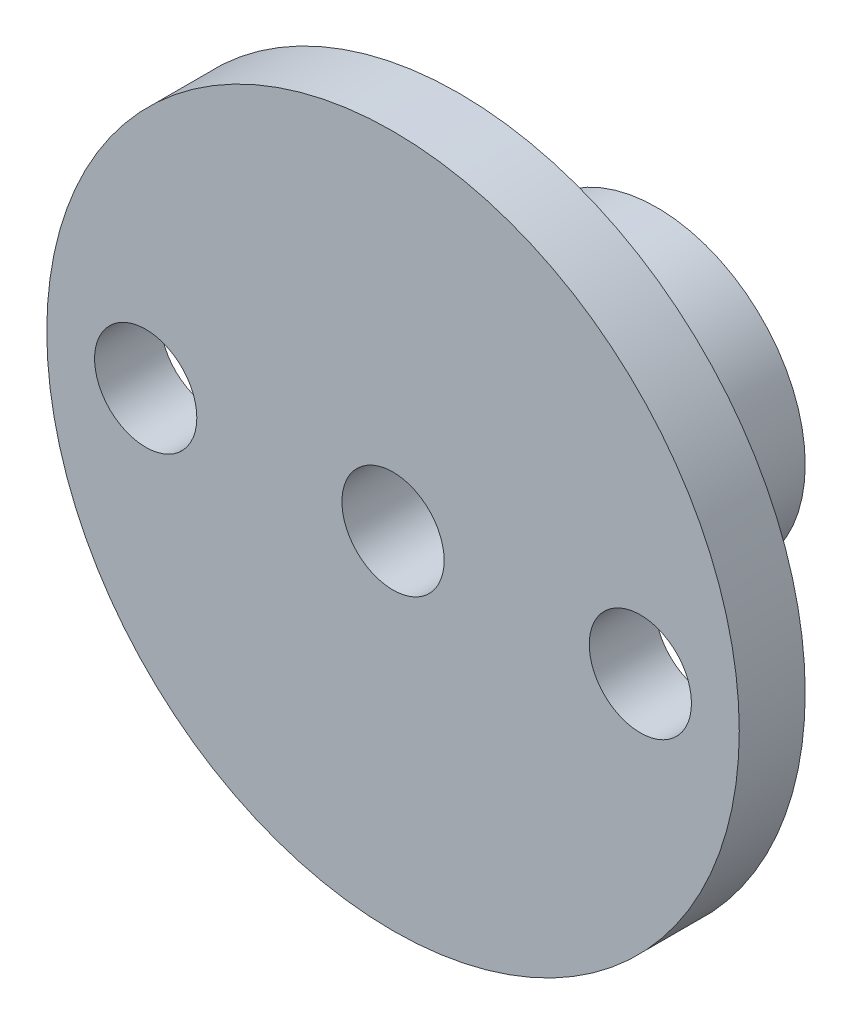
ISO-10303-21;
HEADER;
FILE_DESCRIPTION(('STEP AP214'),'2;1');
FILE_NAME('part.step','',(''),(''),'','','');
FILE_SCHEMA(('AUTOMOTIVE_DESIGN { 1 0 10303 214 1 1 1 1 }'));
ENDSEC;
DATA;
#1=APPLICATION_CONTEXT('core data for automotive mechanical design processes');
#2=APPLICATION_PROTOCOL_DEFINITION('international standard','automotive_design',2000,#1);
#3=PRODUCT_CONTEXT('',#1,'mechanical');
#4=PRODUCT('Part','Part','',(#3));
#5=PRODUCT_RELATED_PRODUCT_CATEGORY('part','',(#4));
#6=PRODUCT_DEFINITION_FORMATION('','',#4);
#7=PRODUCT_DEFINITION_CONTEXT('part definition',#1,'design');
#8=PRODUCT_DEFINITION('design','',#6,#7);
#9=PRODUCT_DEFINITION_SHAPE('','',#8);
#10=(LENGTH_UNIT() NAMED_UNIT(*) SI_UNIT(.MILLI.,.METRE.));
#11=(NAMED_UNIT(*) PLANE_ANGLE_UNIT() SI_UNIT($,.RADIAN.));
#12=(NAMED_UNIT(*) SI_UNIT($,.STERADIAN.) SOLID_ANGLE_UNIT());
#13=UNCERTAINTY_MEASURE_WITH_UNIT(LENGTH_MEASURE(1.E-05),#10,'distance_accuracy_value','');
#14=(GEOMETRIC_REPRESENTATION_CONTEXT(3) GLOBAL_UNCERTAINTY_ASSIGNED_CONTEXT((#13)) GLOBAL_UNIT_ASSIGNED_CONTEXT((#10,
#11,#12)) REPRESENTATION_CONTEXT('',''));
#15=CARTESIAN_POINT('',(0.,0.,0.));
#16=DIRECTION('',(0.,0.,1.));
#17=DIRECTION('',(1.,0.,0.));
#18=AXIS2_PLACEMENT_3D('',#15,#16,#17);
#19=CARTESIAN_POINT('',(0.,0.,6.));
#20=DIRECTION('',(0.,0.,-1.));
#21=DIRECTION('',(-1.,0.,0.));
#22=AXIS2_PLACEMENT_3D('',#19,#20,#21);
#23=CYLINDRICAL_SURFACE('',#22,4.5);
#24=CARTESIAN_POINT('',(0.,-4.5,4.5));
#25=CARTESIAN_POINT('',(0.0818450443300831,-4.50000022951416,4.50000038059746));
#26=CARTESIAN_POINT('',(0.163687791807823,-4.49774654261317,4.49327960080918));
#27=CARTESIAN_POINT('',(0.324962641309457,-4.48897815304921,4.46665633677417));
#28=CARTESIAN_POINT('',(0.404394492178225,-4.48246300803229,4.44675248407662));
#29=CARTESIAN_POINT('',(0.558499184252662,-4.46587961859664,4.39452113492393));
#30=CARTESIAN_POINT('',(0.63317973882905,-4.4558173159628,4.36221440631109));
#31=CARTESIAN_POINT('',(0.776062405207986,-4.43316668576013,4.28618824074248));
#32=CARTESIAN_POINT('',(0.844263235438057,-4.42057786001667,4.2424665524961));
#33=CARTESIAN_POINT('',(0.974612512533398,-4.39371141664507,4.14326129271187));
#34=CARTESIAN_POINT('',(1.03650555044746,-4.37939334695677,4.08745314860926));
#35=CARTESIAN_POINT('',(1.15024903905312,-4.35090472174682,3.96634926794015));
#36=CARTESIAN_POINT('',(1.20209727823419,-4.33673419935824,3.90105144760723));
#37=CARTESIAN_POINT('',(1.29573741334179,-4.30969998715911,3.76052232720531));
#38=CARTESIAN_POINT('',(1.33719728733155,-4.29688558913532,3.68505939040182));
#39=CARTESIAN_POINT('',(1.40672831081658,-4.27462958127902,3.52773585831218));
#40=CARTESIAN_POINT('',(1.43480354608015,-4.26518694241118,3.44587722425589));
#41=CARTESIAN_POINT('',(1.47581019226374,-4.25116954904066,3.28099016775493));
#42=CARTESIAN_POINT('',(1.48922017240765,-4.24644143654417,3.1980941872664));
#43=CARTESIAN_POINT('',(1.50201168500171,-4.24193484944261,3.03110436876618));
#44=CARTESIAN_POINT('',(1.50139755240708,-4.24215484534095,2.94701090893622));
#45=CARTESIAN_POINT('',(1.48652985555513,-4.2473852251227,2.78409505433397));
#46=CARTESIAN_POINT('',(1.47290086975049,-4.25217623801299,2.70520739562147));
#47=CARTESIAN_POINT('',(1.43340924427412,-4.26564986586826,2.55090987058975));
#48=CARTESIAN_POINT('',(1.4075451398878,-4.27433294676161,2.4755004218474));
#49=CARTESIAN_POINT('',(1.34390858709031,-4.29476866696873,2.32888087561278));
#50=CARTESIAN_POINT('',(1.30595107306089,-4.30656848689676,2.25775796179571));
#51=CARTESIAN_POINT('',(1.21933365945471,-4.3318883786359,2.12269363758041));
#52=CARTESIAN_POINT('',(1.17067066854601,-4.34540894685695,2.05875430959993));
#53=CARTESIAN_POINT('',(1.06102399902335,-4.37350993751611,1.93636260275884));
#54=CARTESIAN_POINT('',(0.999529725114466,-4.38810884032264,1.8783709582364));
#55=CARTESIAN_POINT('',(0.867509354955094,-4.41610407580555,1.7734031000049));
#56=CARTESIAN_POINT('',(0.79698239349122,-4.42950029307101,1.72642794275326));
#57=CARTESIAN_POINT('',(0.6479214195694,-4.4537566190669,1.6444555496474));
#58=CARTESIAN_POINT('',(0.569314914624503,-4.46459025012059,1.6095817629889));
#59=CARTESIAN_POINT('',(0.40690362504676,-4.48230850716652,1.55369523906643));
#60=CARTESIAN_POINT('',(0.323100657232429,-4.48919450482319,1.53267768686484));
#61=CARTESIAN_POINT('',(0.156575744293954,-4.49801440607161,1.50591650096646));
#62=CARTESIAN_POINT('',(0.0739643997972675,-4.50015002750592,1.49955028624087));
#63=CARTESIAN_POINT('',(-0.0911626049403579,-4.49983354042241,1.5004990103977));
#64=CARTESIAN_POINT('',(-0.173678278979477,-4.49738220629043,1.50781163996982));
#65=CARTESIAN_POINT('',(-0.333779799456385,-4.48830037075656,1.53541786160394));
#66=CARTESIAN_POINT('',(-0.411439210252267,-4.48179298066788,1.55532930907424));
#67=CARTESIAN_POINT('',(-0.562283937869362,-4.46537770245105,1.60709016670009));
#68=CARTESIAN_POINT('',(-0.635468682762911,-4.45546938070013,1.63894109920168));
#69=CARTESIAN_POINT('',(-0.777432444589911,-4.43293396930935,1.71460564776118));
#70=CARTESIAN_POINT('',(-0.846044938825722,-4.42024222133679,1.75871188992476));
#71=CARTESIAN_POINT('',(-0.975097245203381,-4.39357880874393,1.85729122502023));
#72=CARTESIAN_POINT('',(-1.03553455169337,-4.37960675390741,1.91176748404765));
#73=CARTESIAN_POINT('',(-1.14937876170945,-4.35115271970667,2.03246812650988));
#74=CARTESIAN_POINT('',(-1.20234145386866,-4.33667641631142,2.09911384039029));
#75=CARTESIAN_POINT('',(-1.29638628348536,-4.30949959942063,2.24065735171633));
#76=CARTESIAN_POINT('',(-1.33746832189652,-4.29679910073003,2.31555521795112));
#77=CARTESIAN_POINT('',(-1.40639539562454,-4.27473587687075,2.47150952293484));
#78=CARTESIAN_POINT('',(-1.43426719824753,-4.26536641189468,2.55255311875315));
#79=CARTESIAN_POINT('',(-1.47584200013904,-4.25116248459674,2.7185679750662));
#80=CARTESIAN_POINT('',(-1.48955138243091,-4.24632597935459,2.80353744810653));
#81=CARTESIAN_POINT('',(-1.50191442371601,-4.24196788311266,2.97029564406138));
#82=CARTESIAN_POINT('',(-1.5013053859626,-4.24218600386123,3.05202351043024));
#83=CARTESIAN_POINT('',(-1.48686344017304,-4.24726904735801,3.21414761238309));
#84=CARTESIAN_POINT('',(-1.47303131918788,-4.25213369354042,3.29454392693263));
#85=CARTESIAN_POINT('',(-1.43305771969402,-4.26576786457337,3.45020349450371));
#86=CARTESIAN_POINT('',(-1.40715501902327,-4.27446147033716,3.52553523750675));
#87=CARTESIAN_POINT('',(-1.34396904863962,-4.29474598227703,3.6708411104074));
#88=CARTESIAN_POINT('',(-1.30668325283071,-4.3063375314509,3.74081404678201));
#89=CARTESIAN_POINT('',(-1.21989103887515,-4.33174243839069,3.87672550488437));
#90=CARTESIAN_POINT('',(-1.16992236414687,-4.34563067463205,3.94235475284758));
#91=CARTESIAN_POINT('',(-1.05996432470347,-4.37375034424879,4.0645347200763));
#92=CARTESIAN_POINT('',(-0.999972126677224,-4.38798187368558,4.12108286353211));
#93=CARTESIAN_POINT('',(-0.868862335381034,-4.41585045788316,4.22571661843377));
#94=CARTESIAN_POINT('',(-0.797402270249595,-4.42944272701885,4.2733865216265));
#95=CARTESIAN_POINT('',(-0.647036036109939,-4.45388986758918,4.35598564327597));
#96=CARTESIAN_POINT('',(-0.568131777198525,-4.46474543861895,4.39091811888306));
#97=CARTESIAN_POINT('',(-0.408740470801466,-4.48208272602813,4.44558244873301));
#98=CARTESIAN_POINT('',(-0.328481636514615,-4.48873818633784,4.46592369939507));
#99=CARTESIAN_POINT('',(-0.165480624015372,-4.49769610596333,4.49313042101569));
#100=CARTESIAN_POINT('',(-0.0827391383531211,-4.49999976797857,4.49999961524481));
#101=CARTESIAN_POINT('',(0.,-4.5,4.5));
#102=B_SPLINE_CURVE_WITH_KNOTS('',3,(#24,#25,#26,#27,#28,#29,#30,#31,#32,#33,#34,#35,#36,#37,
#38,#39,#40,#41,#42,#43,#44,#45,#46,#47,#48,#49,#50,#51,#52,#53,#54,#55,#56,#57,#58,#59,#60,#61,
#62,#63,#64,#65,#66,#67,#68,#69,#70,#71,#72,#73,#74,#75,#76,#77,#78,#79,#80,#81,#82,#83,#84,#85,
#86,#87,#88,#89,#90,#91,#92,#93,#94,#95,#96,#97,#98,#99,#100,#101),.UNSPECIFIED.,.T.,.F.,(4,2,2,
2,2,2,2,2,2,2,2,2,2,2,2,2,2,2,2,2,2,2,2,2,2,2,2,2,2,2,2,2,2,2,2,2,2,2,4),(0.,0.245230659039016,
0.490486777901281,0.735334009305411,0.98022956669865,1.23277026424134,1.48536649931295,
1.74522577235206,2.0050056703925,2.2560288861276,2.50697450981228,2.7464523982692,
2.98595896283223,3.22932256732696,3.47275653837311,3.7288995871705,3.98506718949927,
4.24377608475536,4.50239503315813,4.74980374762755,4.99717069746265,5.2373723696732,
5.47760467926156,5.72415599765605,5.97078271232837,6.22861534321128,6.48645012352495,
6.74376020740156,7.0009542705876,7.24493499096387,7.48890119027063,7.72823380620626,
7.96761957263966,8.21745100037707,8.46735316685668,8.72699491252651,8.98657021728684,
9.23454837560721,9.4824579905721),.UNSPECIFIED.);
#103=CARTESIAN_POINT('',(0.,-4.5,4.5));
#104=VERTEX_POINT('',#103);
#105=EDGE_CURVE('E56',#104,#104,#102,.T.);
#106=ORIENTED_EDGE('',*,*,#105,.T.);
#107=EDGE_LOOP('',(#106));
#108=FACE_BOUND('',#107,.T.);
#109=CARTESIAN_POINT('',(0.,0.,6.));
#110=DIRECTION('',(0.,0.,1.));
#111=DIRECTION('',(1.,0.,0.));
#112=AXIS2_PLACEMENT_3D('',#109,#110,#111);
#113=CIRCLE('',#112,4.5);
#114=CARTESIAN_POINT('',(4.5,0.,6.));
#115=VERTEX_POINT('',#114);
#116=EDGE_CURVE('E10',#115,#115,#113,.T.);
#117=ORIENTED_EDGE('',*,*,#116,.F.);
#118=EDGE_LOOP('',(#117));
#119=FACE_BOUND('',#118,.T.);
#120=CARTESIAN_POINT('',(0.,0.,0.));
#121=DIRECTION('',(0.,0.,1.));
#122=DIRECTION('',(1.,0.,0.));
#123=AXIS2_PLACEMENT_3D('',#120,#121,#122);
#124=CIRCLE('',#123,4.5);
#125=CARTESIAN_POINT('',(4.5,0.,0.));
#126=VERTEX_POINT('',#125);
#127=EDGE_CURVE('E26',#126,#126,#124,.T.);
#128=ORIENTED_EDGE('',*,*,#127,.T.);
#129=EDGE_LOOP('',(#128));
#130=FACE_BOUND('',#129,.T.);
#131=ADVANCED_FACE('F14',(#108,#119,#130),#23,.T.);
#132=CARTESIAN_POINT('',(0.,0.,0.));
#133=DIRECTION('',(0.,0.,1.));
#134=DIRECTION('',(1.,0.,0.));
#135=AXIS2_PLACEMENT_3D('',#132,#133,#134);
#136=PLANE('',#135);
#137=CARTESIAN_POINT('',(0.,0.,0.));
#138=DIRECTION('',(0.,0.,1.));
#139=DIRECTION('',(1.,0.,0.));
#140=AXIS2_PLACEMENT_3D('',#137,#138,#139);
#141=CIRCLE('',#140,1.55);
#142=CARTESIAN_POINT('',(1.55,0.,0.));
#143=VERTEX_POINT('',#142);
#144=EDGE_CURVE('E38',#143,#143,#141,.T.);
#145=ORIENTED_EDGE('',*,*,#144,.T.);
#146=EDGE_LOOP('',(#145));
#147=FACE_BOUND('',#146,.T.);
#148=ORIENTED_EDGE('',*,*,#127,.F.);
#149=EDGE_LOOP('',(#148));
#150=FACE_BOUND('',#149,.T.);
#151=ADVANCED_FACE('F83',(#147,#150),#136,.F.);
#152=CARTESIAN_POINT('',(0.,0.,6.));
#153=DIRECTION('',(0.,0.,1.));
#154=DIRECTION('',(1.,0.,0.));
#155=AXIS2_PLACEMENT_3D('',#152,#153,#154);
#156=PLANE('',#155);
#157=CARTESIAN_POINT('',(7.5,0.,6.));
#158=DIRECTION('',(0.,0.,1.));
#159=DIRECTION('',(1.,0.,0.));
#160=AXIS2_PLACEMENT_3D('',#157,#158,#159);
#161=CIRCLE('',#160,1.55);
#162=CARTESIAN_POINT('',(9.05,0.,6.));
#163=VERTEX_POINT('',#162);
#164=EDGE_CURVE('E50',#163,#163,#161,.T.);
#165=ORIENTED_EDGE('',*,*,#164,.T.);
#166=EDGE_LOOP('',(#165));
#167=FACE_BOUND('',#166,.T.);
#168=CARTESIAN_POINT('',(-7.5,0.,6.));
#169=DIRECTION('',(0.,0.,1.));
#170=DIRECTION('',(1.,0.,0.));
#171=AXIS2_PLACEMENT_3D('',#168,#169,#170);
#172=CIRCLE('',#171,1.55);
#173=CARTESIAN_POINT('',(-5.95,0.,6.));
#174=VERTEX_POINT('',#173);
#175=EDGE_CURVE('E44',#174,#174,#172,.T.);
#176=ORIENTED_EDGE('',*,*,#175,.T.);
#177=EDGE_LOOP('',(#176));
#178=FACE_BOUND('',#177,.T.);
#179=CARTESIAN_POINT('',(0.,0.,6.));
#180=DIRECTION('',(0.,0.,1.));
#181=DIRECTION('',(1.,0.,0.));
#182=AXIS2_PLACEMENT_3D('',#179,#180,#181);
#183=CIRCLE('',#182,10.5);
#184=CARTESIAN_POINT('',(10.5,0.,6.));
#185=VERTEX_POINT('',#184);
#186=EDGE_CURVE('E35',#185,#185,#183,.T.);
#187=ORIENTED_EDGE('',*,*,#186,.F.);
#188=EDGE_LOOP('',(#187));
#189=FACE_BOUND('',#188,.T.);
#190=ORIENTED_EDGE('',*,*,#116,.T.);
#191=EDGE_LOOP('',(#190));
#192=FACE_BOUND('',#191,.T.);
#193=ADVANCED_FACE('F79',(#167,#178,#189,#192),#156,.F.);
#194=CARTESIAN_POINT('',(0.,0.,8.));
#195=DIRECTION('',(0.,0.,-1.));
#196=DIRECTION('',(-1.,0.,0.));
#197=AXIS2_PLACEMENT_3D('',#194,#195,#196);
#198=CYLINDRICAL_SURFACE('',#197,10.5);
#199=CARTESIAN_POINT('',(0.,0.,8.));
#200=DIRECTION('',(0.,0.,1.));
#201=DIRECTION('',(1.,0.,0.));
#202=AXIS2_PLACEMENT_3D('',#199,#200,#201);
#203=CIRCLE('',#202,10.5);
#204=CARTESIAN_POINT('',(10.5,0.,8.));
#205=VERTEX_POINT('',#204);
#206=EDGE_CURVE('E30',#205,#205,#203,.T.);
#207=ORIENTED_EDGE('',*,*,#206,.F.);
#208=EDGE_LOOP('',(#207));
#209=FACE_BOUND('',#208,.T.);
#210=ORIENTED_EDGE('',*,*,#186,.T.);
#211=EDGE_LOOP('',(#210));
#212=FACE_BOUND('',#211,.T.);
#213=ADVANCED_FACE('F82',(#209,#212),#198,.T.);
#214=CARTESIAN_POINT('',(0.,0.,8.));
#215=DIRECTION('',(0.,0.,1.));
#216=DIRECTION('',(1.,0.,0.));
#217=AXIS2_PLACEMENT_3D('',#214,#215,#216);
#218=PLANE('',#217);
#219=CARTESIAN_POINT('',(7.5,0.,8.));
#220=DIRECTION('',(0.,0.,1.));
#221=DIRECTION('',(1.,0.,0.));
#222=AXIS2_PLACEMENT_3D('',#219,#220,#221);
#223=CIRCLE('',#222,1.55);
#224=CARTESIAN_POINT('',(9.05,0.,8.));
#225=VERTEX_POINT('',#224);
#226=EDGE_CURVE('E53',#225,#225,#223,.T.);
#227=ORIENTED_EDGE('',*,*,#226,.F.);
#228=EDGE_LOOP('',(#227));
#229=FACE_BOUND('',#228,.T.);
#230=CARTESIAN_POINT('',(-7.5,0.,8.));
#231=DIRECTION('',(0.,0.,1.));
#232=DIRECTION('',(1.,0.,0.));
#233=AXIS2_PLACEMENT_3D('',#230,#231,#232);
#234=CIRCLE('',#233,1.55);
#235=CARTESIAN_POINT('',(-5.95,0.,8.));
#236=VERTEX_POINT('',#235);
#237=EDGE_CURVE('E47',#236,#236,#234,.T.);
#238=ORIENTED_EDGE('',*,*,#237,.F.);
#239=EDGE_LOOP('',(#238));
#240=FACE_BOUND('',#239,.T.);
#241=CARTESIAN_POINT('',(0.,0.,8.));
#242=DIRECTION('',(0.,0.,1.));
#243=DIRECTION('',(1.,0.,0.));
#244=AXIS2_PLACEMENT_3D('',#241,#242,#243);
#245=CIRCLE('',#244,1.55);
#246=CARTESIAN_POINT('',(1.55,0.,8.));
#247=VERTEX_POINT('',#246);
#248=EDGE_CURVE('E41',#247,#247,#245,.T.);
#249=ORIENTED_EDGE('',*,*,#248,.F.);
#250=EDGE_LOOP('',(#249));
#251=FACE_BOUND('',#250,.T.);
#252=ORIENTED_EDGE('',*,*,#206,.T.);
#253=EDGE_LOOP('',(#252));
#254=FACE_BOUND('',#253,.T.);
#255=ADVANCED_FACE('F77',(#229,#240,#251,#254),#218,.T.);
#256=CARTESIAN_POINT('',(0.,0.,0.));
#257=DIRECTION('',(0.,0.,1.));
#258=DIRECTION('',(1.,0.,0.));
#259=AXIS2_PLACEMENT_3D('',#256,#257,#258);
#260=CYLINDRICAL_SURFACE('',#259,1.55);
#261=CARTESIAN_POINT('',(0.,-1.55,4.5));
#262=CARTESIAN_POINT('',(-0.0676355330274366,-1.54999081843046,4.49999076368759));
#263=CARTESIAN_POINT('',(-0.135385038064904,-1.54552730815956,4.49537962706916));
#264=CARTESIAN_POINT('',(-0.268656128092148,-1.52802940917958,4.47728767559424));
#265=CARTESIAN_POINT('',(-0.334170585245087,-1.51496988620329,4.46378085016549));
#266=CARTESIAN_POINT('',(-0.460531661005094,-1.48143605448111,4.42904623801899));
#267=CARTESIAN_POINT('',(-0.521408709249814,-1.46101625363012,4.40787520512207));
#268=CARTESIAN_POINT('',(-0.637888892089841,-1.41405401872415,4.35907782461948));
#269=CARTESIAN_POINT('',(-0.693492939511155,-1.38751264713421,4.33145259719855));
#270=CARTESIAN_POINT('',(-0.820581634788789,-1.31770149581901,4.25856612544725));
#271=CARTESIAN_POINT('',(-0.889256412159932,-1.27203025962067,4.21071351864878));
#272=CARTESIAN_POINT('',(-1.01520576989899,-1.17399180153672,4.1072649019925));
#273=CARTESIAN_POINT('',(-1.07244587684376,-1.12160509050306,4.05164631060456));
#274=CARTESIAN_POINT('',(-1.15905645809111,-1.03036877243889,3.95360727945747));
#275=CARTESIAN_POINT('',(-1.19144642006318,-0.992635667006653,3.91275281029674));
#276=CARTESIAN_POINT('',(-1.25138700905586,-0.915914787426984,3.82867328414724));
#277=CARTESIAN_POINT('',(-1.27893455042558,-0.8769262318756,3.78544673849274));
#278=CARTESIAN_POINT('',(-1.32929209619449,-0.798530053193021,3.69683318220178));
#279=CARTESIAN_POINT('',(-1.35210921725435,-0.7591231547276,3.65144954512515));
#280=CARTESIAN_POINT('',(-1.39316851278601,-0.680824833031678,3.55828190125809));
#281=CARTESIAN_POINT('',(-1.41141486057361,-0.641932970513509,3.51050013227713));
#282=CARTESIAN_POINT('',(-1.43796585474672,-0.579220247170031,3.42829625229903));
#283=CARTESIAN_POINT('',(-1.44754930690894,-0.554734187823024,3.39479308281068));
#284=CARTESIAN_POINT('',(-1.46463329583353,-0.507900505941637,3.32575704458973));
#285=CARTESIAN_POINT('',(-1.4721343935952,-0.485552308519332,3.29022472563902));
#286=CARTESIAN_POINT('',(-1.48283152463227,-0.451580002246385,3.22776570530092));
#287=CARTESIAN_POINT('',(-1.48664094036618,-0.438782056021784,3.20159858855609));
#288=CARTESIAN_POINT('',(-1.4929607756499,-0.416772507905548,3.14764866260204));
#289=CARTESIAN_POINT('',(-1.49547530893552,-0.407549571880429,3.11987128590343));
#290=CARTESIAN_POINT('',(-1.49854011071256,-0.396112814231927,3.06964887056954));
#291=CARTESIAN_POINT('',(-1.49941413846041,-0.392757694838758,3.04749491759403));
#292=CARTESIAN_POINT('',(-1.50016193526527,-0.389893808440604,3.00293704360337));
#293=CARTESIAN_POINT('',(-1.50003712302609,-0.390379586000367,2.98053352224507));
#294=CARTESIAN_POINT('',(-1.4988087528499,-0.39506514541176,2.93625948035088));
#295=CARTESIAN_POINT('',(-1.49770901081175,-0.399250447051156,2.91438722300598));
#296=CARTESIAN_POINT('',(-1.49463886434278,-0.410597810421201,2.8714768493076));
#297=CARTESIAN_POINT('',(-1.49266644232335,-0.417766767909632,2.85044078974705));
#298=CARTESIAN_POINT('',(-1.48421675577554,-0.447289588754999,2.77634201819846));
#299=CARTESIAN_POINT('',(-1.4755864871079,-0.475563845772816,2.72599318100967));
#300=CARTESIAN_POINT('',(-1.45432019738923,-0.537178739458939,2.62929998699831));
#301=CARTESIAN_POINT('',(-1.44164953074072,-0.570561845752358,2.58299484896806));
#302=CARTESIAN_POINT('',(-1.41119167479362,-0.642413158273151,2.48893535236883));
#303=CARTESIAN_POINT('',(-1.39304229169765,-0.681067117658285,2.44143635457927));
#304=CARTESIAN_POINT('',(-1.3522289371783,-0.758893263977788,2.34881744103721));
#305=CARTESIAN_POINT('',(-1.32956049851529,-0.798065927609299,2.30369993573671));
#306=CARTESIAN_POINT('',(-1.27968080639221,-0.875809766059643,2.21580694970387));
#307=CARTESIAN_POINT('',(-1.25248535967426,-0.914382540158545,2.17302398471942));
#308=CARTESIAN_POINT('',(-1.19335707270961,-0.990310294747422,2.08977861731749));
#309=CARTESIAN_POINT('',(-1.16142733296677,-1.02766605288111,2.04931472000336));
#310=CARTESIAN_POINT('',(-1.07706051760185,-1.11702184078186,1.95325442762864));
#311=CARTESIAN_POINT('',(-1.02187542128094,-1.16801390921705,1.89907974324001));
#312=CARTESIAN_POINT('',(-0.900638243110895,-1.26384571665305,1.79789154380219));
#313=CARTESIAN_POINT('',(-0.83460036052109,-1.30869335597762,1.75086882423208));
#314=CARTESIAN_POINT('',(-0.707364744329703,-1.38066834191321,1.67567552744845));
#315=CARTESIAN_POINT('',(-0.648265804662647,-1.40952616528861,1.64563098065843));
#316=CARTESIAN_POINT('',(-0.524040425774734,-1.46026443944318,1.59290235946652));
#317=CARTESIAN_POINT('',(-0.458917640809076,-1.48214908501786,1.57021385980509));
#318=CARTESIAN_POINT('',(-0.323357261638141,-1.51752526844459,1.53357374645812));
#319=CARTESIAN_POINT('',(-0.252877834811499,-1.53094103013228,1.51970100549066));
#320=CARTESIAN_POINT('',(-0.109496119878139,-1.54780630384202,1.50226522276312));
#321=CARTESIAN_POINT('',(-0.0365960895639781,-1.55126485309303,1.49869283233536));
#322=CARTESIAN_POINT('',(0.0984919810263352,-1.5481331430729,1.50192922429916));
#323=CARTESIAN_POINT('',(0.160752682035289,-1.54288022059812,1.50735642672839));
#324=CARTESIAN_POINT('',(0.283103371878392,-1.52517972072979,1.5256599529116));
#325=CARTESIAN_POINT('',(0.343193125040594,-1.51273136469899,1.53853708284245));
#326=CARTESIAN_POINT('',(0.459883486074441,-1.48144097259974,1.57094947036583));
#327=CARTESIAN_POINT('',(0.51647755851908,-1.46258736499715,1.59049677838429));
#328=CARTESIAN_POINT('',(0.625185056628177,-1.41953103602407,1.63522737415673));
#329=CARTESIAN_POINT('',(0.677296955637218,-1.39532650203913,1.66041257176986));
#330=CARTESIAN_POINT('',(0.801143016952371,-1.32955531942303,1.72903211765454));
#331=CARTESIAN_POINT('',(0.869873446620252,-1.28531444673555,1.7753396197126));
#332=CARTESIAN_POINT('',(0.996221572518743,-1.19010260703674,1.87568410667081));
#333=CARTESIAN_POINT('',(1.05380501309096,-1.13911168031631,1.92974405643647));
#334=CARTESIAN_POINT('',(1.17684019417416,-1.01377239339767,2.06401686627486));
#335=CARTESIAN_POINT('',(1.23776700867064,-0.937582193271958,2.14667831584558));
#336=CARTESIAN_POINT('',(1.3151807465359,-0.821565625582562,2.27692370827614));
#337=CARTESIAN_POINT('',(1.33865419259973,-0.782609044063364,2.3213760810914));
#338=CARTESIAN_POINT('',(1.38111453148267,-0.704958805751522,2.41258360426441));
#339=CARTESIAN_POINT('',(1.40010488794504,-0.666264968560328,2.45933694291689));
#340=CARTESIAN_POINT('',(1.42865852656184,-0.601900746736164,2.54149913709553));
#341=CARTESIAN_POINT('',(1.43934747871827,-0.575770422288713,2.57616168570283));
#342=CARTESIAN_POINT('',(1.45846916957239,-0.525437401582563,2.64752737546126));
#343=CARTESIAN_POINT('',(1.46690169224684,-0.501234890042081,2.68423071158479));
#344=CARTESIAN_POINT('',(1.47915836826864,-0.463531921663727,2.74932207824781));
#345=CARTESIAN_POINT('',(1.48360817410217,-0.448980349699616,2.77696988349882));
#346=CARTESIAN_POINT('',(1.49107253782405,-0.423530203157789,2.83408964249794));
#347=CARTESIAN_POINT('',(1.4940916438818,-0.412620085612812,2.86355547451738));
#348=CARTESIAN_POINT('',(1.49778533654472,-0.398968516937341,2.91565703866731));
#349=CARTESIAN_POINT('',(1.49888133135799,-0.394790034674028,2.93787033212664));
#350=CARTESIAN_POINT('',(1.50006670712492,-0.390264522703645,2.98268993015208));
#351=CARTESIAN_POINT('',(1.50015818188904,-0.389909523400769,3.005295318828));
#352=CARTESIAN_POINT('',(1.49932930092276,-0.393081437578558,3.05015589078406));
#353=CARTESIAN_POINT('',(1.4984106800186,-0.396601695367221,3.07241160812662));
#354=CARTESIAN_POINT('',(1.49565869150686,-0.40685869702317,3.11613176726924));
#355=CARTESIAN_POINT('',(1.49382290141956,-0.41360395691013,3.13759395104915));
#356=CARTESIAN_POINT('',(1.4862845739818,-0.440249186294608,3.20856756053518));
#357=CARTESIAN_POINT('',(1.47874616727958,-0.465438051484511,3.25580647617895));
#358=CARTESIAN_POINT('',(1.46016045684435,-0.520882549801477,3.34654557972253));
#359=CARTESIAN_POINT('',(1.4490845435901,-0.551178508706016,3.39001147521416));
#360=CARTESIAN_POINT('',(1.42262028470986,-0.61643405505558,3.47793021216763));
#361=CARTESIAN_POINT('',(1.40695141884877,-0.651572172361468,3.52216831315903));
#362=CARTESIAN_POINT('',(1.37182844375827,-0.722612129331189,3.60848745748285));
#363=CARTESIAN_POINT('',(1.35237085660005,-0.75851464351006,3.6505664736545));
#364=CARTESIAN_POINT('',(1.28834402847887,-0.865777158040825,3.77378058596444));
#365=CARTESIAN_POINT('',(1.23801928130953,-0.936960087552604,3.85222537758818));
#366=CARTESIAN_POINT('',(1.13058528030718,-1.06301849612507,3.98895814812841));
#367=CARTESIAN_POINT('',(1.07590721072428,-1.11866431650513,4.04845021921719));
#368=CARTESIAN_POINT('',(0.954447838165032,-1.22391085594574,4.16009192792526));
#369=CARTESIAN_POINT('',(0.887682056914328,-1.27351919263805,4.21225083115024));
#370=CARTESIAN_POINT('',(0.759622362999432,-1.35265987520472,4.29510454046085));
#371=CARTESIAN_POINT('',(0.700925812060848,-1.38414365789187,4.32793739889534));
#372=CARTESIAN_POINT('',(0.576916619219204,-1.44023569865417,4.38630627969614));
#373=CARTESIAN_POINT('',(0.511609170745664,-1.4648492976012,4.41184797055947));
#374=CARTESIAN_POINT('',(0.38551316044794,-1.50251917851428,4.45089136321836));
#375=CARTESIAN_POINT('',(0.325447285448168,-1.51673524769351,4.46560339794699));
#376=CARTESIAN_POINT('',(0.202808330107078,-1.53792449462109,4.48752141126474));
#377=CARTESIAN_POINT('',(0.1402427016429,-1.54491774219481,4.49474818906005));
#378=CARTESIAN_POINT('',(0.0516188490255356,-1.54935797402675,4.49933651331712));
#379=CARTESIAN_POINT('',(0.0258177278832544,-1.55000350477409,4.50000352567046));
#380=CARTESIAN_POINT('',(0.,-1.55,4.5));
#381=B_SPLINE_CURVE_WITH_KNOTS('',3,(#261,#262,#263,#264,#265,#266,#267,#268,#269,#270,#271,
#272,#273,#274,#275,#276,#277,#278,#279,#280,#281,#282,#283,#284,#285,#286,#287,#288,#289,#290,
#291,#292,#293,#294,#295,#296,#297,#298,#299,#300,#301,#302,#303,#304,#305,#306,#307,#308,#309,
#310,#311,#312,#313,#314,#315,#316,#317,#318,#319,#320,#321,#322,#323,#324,#325,#326,#327,#328,
#329,#330,#331,#332,#333,#334,#335,#336,#337,#338,#339,#340,#341,#342,#343,#344,#345,#346,#347,
#348,#349,#350,#351,#352,#353,#354,#355,#356,#357,#358,#359,#360,#361,#362,#363,#364,#365,#366,
#367,#368,#369,#370,#371,#372,#373,#374,#375,#376,#377,#378,#379,#380),.UNSPECIFIED.,.T.,.F.,(4,
2,2,2,2,2,2,2,2,2,2,2,2,2,2,2,2,2,2,2,2,2,2,2,2,2,2,2,2,2,2,2,2,2,2,2,2,2,2,2,2,2,2,2,2,2,2,2,2,
2,2,2,2,2,2,2,2,2,2,4),(0.,0.202814510369214,0.406224689313205,0.608158425619283,
0.810057140472106,1.09455653609654,1.37990111332596,1.57274966281357,1.76572065582805,
1.95839919330287,2.15090116032281,2.27858497539441,2.4062343581913,2.49419225375971,
2.58186896309507,2.64882662460042,2.7156891995928,2.78229122263704,2.8490480371617,
3.02281253929225,3.19810902344746,3.3894522776554,3.58098562755559,3.77186372235796,
3.96261735814802,4.23954415156447,4.51611147046008,4.73220774613689,4.94817378010334,
5.16604577824915,5.3837199719582,5.57096073943537,5.75822177253494,5.94582292075647,
6.13348771609461,6.41374072185356,6.69484175338964,7.07625320432193,7.2669191717874,
7.45743734471184,7.59146972942435,7.72551494137496,7.82002553343695,7.91423362831896,
7.98182424901707,8.04927395776677,8.11660800320233,8.18412084292244,8.34503439109423,
8.50728375933479,8.68292719058557,8.85873262372907,9.20903785981622,9.50242130990274,
9.79543066692567,10.0174065500662,10.239209385751,10.428776534471,10.61781551016,
10.6952335418529),.UNSPECIFIED.);
#382=CARTESIAN_POINT('',(0.,-1.55,4.5));
#383=VERTEX_POINT('',#382);
#384=EDGE_CURVE('E18',#383,#383,#381,.T.);
#385=ORIENTED_EDGE('',*,*,#384,.T.);
#386=EDGE_LOOP('',(#385));
#387=FACE_BOUND('',#386,.T.);
#388=ORIENTED_EDGE('',*,*,#144,.F.);
#389=EDGE_LOOP('',(#388));
#390=FACE_BOUND('',#389,.T.);
#391=ORIENTED_EDGE('',*,*,#248,.T.);
#392=EDGE_LOOP('',(#391));
#393=FACE_BOUND('',#392,.T.);
#394=ADVANCED_FACE('F72',(#387,#390,#393),#260,.F.);
#395=CARTESIAN_POINT('',(-7.5,0.,0.));
#396=DIRECTION('',(0.,0.,1.));
#397=DIRECTION('',(1.,0.,0.));
#398=AXIS2_PLACEMENT_3D('',#395,#396,#397);
#399=CYLINDRICAL_SURFACE('',#398,1.55);
#400=ORIENTED_EDGE('',*,*,#237,.T.);
#401=EDGE_LOOP('',(#400));
#402=FACE_BOUND('',#401,.T.);
#403=ORIENTED_EDGE('',*,*,#175,.F.);
#404=EDGE_LOOP('',(#403));
#405=FACE_BOUND('',#404,.T.);
#406=ADVANCED_FACE('F69',(#402,#405),#399,.F.);
#407=CARTESIAN_POINT('',(7.5,0.,0.));
#408=DIRECTION('',(0.,0.,1.));
#409=DIRECTION('',(1.,0.,0.));
#410=AXIS2_PLACEMENT_3D('',#407,#408,#409);
#411=CYLINDRICAL_SURFACE('',#410,1.55);
#412=ORIENTED_EDGE('',*,*,#226,.T.);
#413=EDGE_LOOP('',(#412));
#414=FACE_BOUND('',#413,.T.);
#415=ORIENTED_EDGE('',*,*,#164,.F.);
#416=EDGE_LOOP('',(#415));
#417=FACE_BOUND('',#416,.T.);
#418=ADVANCED_FACE('F64',(#414,#417),#411,.F.);
#419=CARTESIAN_POINT('',(0.,-10.,3.));
#420=DIRECTION('',(0.,1.,0.));
#421=DIRECTION('',(0.,0.,1.));
#422=AXIS2_PLACEMENT_3D('',#419,#420,#421);
#423=CYLINDRICAL_SURFACE('',#422,1.5);
#424=ORIENTED_EDGE('',*,*,#384,.F.);
#425=EDGE_LOOP('',(#424));
#426=FACE_BOUND('',#425,.T.);
#427=ORIENTED_EDGE('',*,*,#105,.F.);
#428=EDGE_LOOP('',(#427));
#429=FACE_BOUND('',#428,.T.);
#430=ADVANCED_FACE('F60',(#426,#429),#423,.F.);
#431=CLOSED_SHELL('',(#131,#151,#193,#213,#255,#394,#406,#418,#430));
#432=MANIFOLD_SOLID_BREP('B1',#431);
#433=ADVANCED_BREP_SHAPE_REPRESENTATION('',(#18,#432),#14);
#434=SHAPE_DEFINITION_REPRESENTATION(#9,#433);
ENDSEC;
END-ISO-10303-21;
